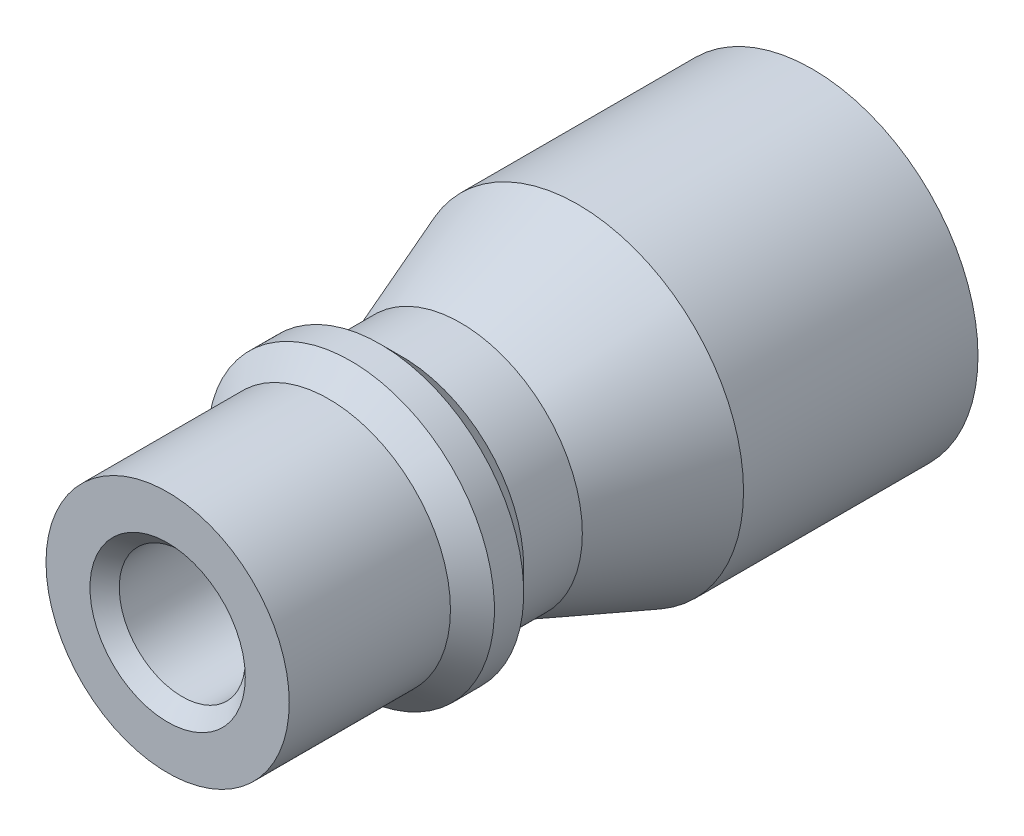
ISO-10303-21;
HEADER;
FILE_DESCRIPTION(('STEP AP214'),'2;1');
FILE_NAME('part.step','',(''),(''),'','','');
FILE_SCHEMA(('AUTOMOTIVE_DESIGN { 1 0 10303 214 1 1 1 1 }'));
ENDSEC;
DATA;
#1=APPLICATION_CONTEXT('core data for automotive mechanical design processes');
#2=APPLICATION_PROTOCOL_DEFINITION('international standard','automotive_design',2000,#1);
#3=PRODUCT_CONTEXT('',#1,'mechanical');
#4=PRODUCT('Part','Part','',(#3));
#5=PRODUCT_RELATED_PRODUCT_CATEGORY('part','',(#4));
#6=PRODUCT_DEFINITION_FORMATION('','',#4);
#7=PRODUCT_DEFINITION_CONTEXT('part definition',#1,'design');
#8=PRODUCT_DEFINITION('design','',#6,#7);
#9=PRODUCT_DEFINITION_SHAPE('','',#8);
#10=(LENGTH_UNIT() NAMED_UNIT(*) SI_UNIT(.MILLI.,.METRE.));
#11=(NAMED_UNIT(*) PLANE_ANGLE_UNIT() SI_UNIT($,.RADIAN.));
#12=(NAMED_UNIT(*) SI_UNIT($,.STERADIAN.) SOLID_ANGLE_UNIT());
#13=UNCERTAINTY_MEASURE_WITH_UNIT(LENGTH_MEASURE(1.E-05),#10,'distance_accuracy_value','');
#14=(GEOMETRIC_REPRESENTATION_CONTEXT(3) GLOBAL_UNCERTAINTY_ASSIGNED_CONTEXT((#13)) GLOBAL_UNIT_ASSIGNED_CONTEXT((#10,
#11,#12)) REPRESENTATION_CONTEXT('',''));
#15=CARTESIAN_POINT('',(0.,0.,0.));
#16=DIRECTION('',(0.,0.,1.));
#17=DIRECTION('',(1.,0.,0.));
#18=AXIS2_PLACEMENT_3D('',#15,#16,#17);
#19=CARTESIAN_POINT('',(0.,0.,22.));
#20=DIRECTION('',(0.,0.,-1.));
#21=DIRECTION('',(-1.,0.,0.));
#22=AXIS2_PLACEMENT_3D('',#19,#20,#21);
#23=CYLINDRICAL_SURFACE('',#22,4.15);
#24=CARTESIAN_POINT('',(0.,0.,14.));
#25=DIRECTION('',(0.,0.,-1.));
#26=DIRECTION('',(-1.,0.,0.));
#27=AXIS2_PLACEMENT_3D('',#24,#25,#26);
#28=CIRCLE('',#27,4.15);
#29=CARTESIAN_POINT('',(-4.15,0.,14.));
#30=VERTEX_POINT('',#29);
#31=EDGE_CURVE('E93',#30,#30,#28,.T.);
#32=ORIENTED_EDGE('',*,*,#31,.T.);
#33=EDGE_LOOP('',(#32));
#34=FACE_BOUND('',#33,.T.);
#35=CARTESIAN_POINT('',(0.,0.,12.));
#36=DIRECTION('',(0.,0.,1.));
#37=DIRECTION('',(1.,0.,0.));
#38=AXIS2_PLACEMENT_3D('',#35,#36,#37);
#39=CIRCLE('',#38,4.15);
#40=CARTESIAN_POINT('',(4.15,0.,12.));
#41=VERTEX_POINT('',#40);
#42=EDGE_CURVE('E55',#41,#41,#39,.T.);
#43=ORIENTED_EDGE('',*,*,#42,.T.);
#44=EDGE_LOOP('',(#43));
#45=FACE_BOUND('',#44,.T.);
#46=ADVANCED_FACE('F34',(#34,#45),#23,.T.);
#47=CARTESIAN_POINT('',(0.,0.,0.));
#48=DIRECTION('',(0.,0.,1.));
#49=DIRECTION('',(1.,0.,0.));
#50=AXIS2_PLACEMENT_3D('',#47,#48,#49);
#51=PLANE('',#50);
#52=CARTESIAN_POINT('',(0.,0.,0.));
#53=DIRECTION('',(0.,0.,1.));
#54=DIRECTION('',(1.,0.,0.));
#55=AXIS2_PLACEMENT_3D('',#52,#53,#54);
#56=CIRCLE('',#55,4.15);
#57=CARTESIAN_POINT('',(4.15,0.,0.));
#58=VERTEX_POINT('',#57);
#59=EDGE_CURVE('E49',#58,#58,#56,.T.);
#60=ORIENTED_EDGE('',*,*,#59,.T.);
#61=EDGE_LOOP('',(#60));
#62=FACE_BOUND('',#61,.T.);
#63=CARTESIAN_POINT('',(0.,0.,0.));
#64=DIRECTION('',(0.,0.,1.));
#65=DIRECTION('',(1.,0.,0.));
#66=AXIS2_PLACEMENT_3D('',#63,#64,#65);
#67=CIRCLE('',#66,5.65);
#68=CARTESIAN_POINT('',(5.65,0.,0.));
#69=VERTEX_POINT('',#68);
#70=EDGE_CURVE('E59',#69,#69,#67,.T.);
#71=ORIENTED_EDGE('',*,*,#70,.F.);
#72=EDGE_LOOP('',(#71));
#73=FACE_BOUND('',#72,.T.);
#74=ADVANCED_FACE('F125',(#62,#73),#51,.F.);
#75=CARTESIAN_POINT('',(0.,0.,8.));
#76=DIRECTION('',(0.,0.,-1.));
#77=DIRECTION('',(-1.,0.,0.));
#78=AXIS2_PLACEMENT_3D('',#75,#76,#77);
#79=CYLINDRICAL_SURFACE('',#78,5.65);
#80=CARTESIAN_POINT('',(0.,0.,8.));
#81=DIRECTION('',(0.,0.,-1.));
#82=DIRECTION('',(-1.,0.,0.));
#83=AXIS2_PLACEMENT_3D('',#80,#81,#82);
#84=CIRCLE('',#83,5.65);
#85=CARTESIAN_POINT('',(-5.65,0.,8.));
#86=VERTEX_POINT('',#85);
#87=EDGE_CURVE('E74',#86,#86,#84,.F.);
#88=ORIENTED_EDGE('',*,*,#87,.F.);
#89=EDGE_LOOP('',(#88));
#90=FACE_BOUND('',#89,.T.);
#91=ORIENTED_EDGE('',*,*,#70,.T.);
#92=EDGE_LOOP('',(#91));
#93=FACE_BOUND('',#92,.T.);
#94=ADVANCED_FACE('F130',(#90,#93),#79,.T.);
#95=CARTESIAN_POINT('',(0.,0.,8.));
#96=DIRECTION('',(0.,0.,-1.));
#97=DIRECTION('',(-1.,0.,0.));
#98=AXIS2_PLACEMENT_3D('',#95,#96,#97);
#99=CYLINDRICAL_SURFACE('',#98,3.65);
#100=CARTESIAN_POINT('',(0.,0.,0.5));
#101=DIRECTION('',(0.,0.,1.));
#102=DIRECTION('',(1.,0.,0.));
#103=AXIS2_PLACEMENT_3D('',#100,#101,#102);
#104=CIRCLE('',#103,3.65);
#105=CARTESIAN_POINT('',(3.65,0.,0.5));
#106=VERTEX_POINT('',#105);
#107=EDGE_CURVE('E45',#106,#106,#104,.F.);
#108=ORIENTED_EDGE('',*,*,#107,.T.);
#109=EDGE_LOOP('',(#108));
#110=FACE_BOUND('',#109,.T.);
#111=CARTESIAN_POINT('',(0.,0.,8.));
#112=DIRECTION('',(0.,0.,-1.));
#113=DIRECTION('',(-1.,0.,0.));
#114=AXIS2_PLACEMENT_3D('',#111,#112,#113);
#115=CIRCLE('',#114,3.65);
#116=CARTESIAN_POINT('',(-3.65,0.,8.));
#117=VERTEX_POINT('',#116);
#118=EDGE_CURVE('E87',#117,#117,#115,.T.);
#119=ORIENTED_EDGE('',*,*,#118,.F.);
#120=EDGE_LOOP('',(#119));
#121=FACE_BOUND('',#120,.T.);
#122=ADVANCED_FACE('F146',(#110,#121),#99,.F.);
#123=CARTESIAN_POINT('',(0.,0.,12.));
#124=DIRECTION('',(0.,0.,-1.));
#125=DIRECTION('',(-1.,0.,0.));
#126=AXIS2_PLACEMENT_3D('',#123,#124,#125);
#127=CONICAL_SURFACE('',#126,4.15,0.358770670270572);
#128=ORIENTED_EDGE('',*,*,#87,.T.);
#129=EDGE_LOOP('',(#128));
#130=FACE_BOUND('',#129,.T.);
#131=ORIENTED_EDGE('',*,*,#42,.F.);
#132=EDGE_LOOP('',(#131));
#133=FACE_BOUND('',#132,.T.);
#134=ADVANCED_FACE('F83',(#130,#133),#127,.T.);
#135=CARTESIAN_POINT('',(0.,0.,8.));
#136=DIRECTION('',(0.,0.,-1.));
#137=DIRECTION('',(-1.,0.,0.));
#138=AXIS2_PLACEMENT_3D('',#135,#136,#137);
#139=CONICAL_SURFACE('',#138,3.65,0.855211333477222);
#140=CARTESIAN_POINT('',(0.,0.,11.));
#141=DIRECTION('',(0.,0.,-1.));
#142=DIRECTION('',(-1.,0.,0.));
#143=AXIS2_PLACEMENT_3D('',#140,#141,#142);
#144=CIRCLE('',#143,0.198894778336966);
#145=CARTESIAN_POINT('',(-0.198894778336966,0.,11.));
#146=VERTEX_POINT('',#145);
#147=EDGE_CURVE('E60',#146,#146,#144,.T.);
#148=ORIENTED_EDGE('',*,*,#147,.F.);
#149=EDGE_LOOP('',(#148));
#150=FACE_BOUND('',#149,.T.);
#151=ORIENTED_EDGE('',*,*,#118,.T.);
#152=EDGE_LOOP('',(#151));
#153=FACE_BOUND('',#152,.T.);
#154=ADVANCED_FACE('F139',(#150,#153),#139,.F.);
#155=CARTESIAN_POINT('',(0.,0.,11.));
#156=DIRECTION('',(0.,0.,-1.));
#157=DIRECTION('',(-1.,0.,0.));
#158=AXIS2_PLACEMENT_3D('',#155,#156,#157);
#159=PLANE('',#158);
#160=ORIENTED_EDGE('',*,*,#147,.T.);
#161=EDGE_LOOP('',(#160));
#162=FACE_BOUND('',#161,.T.);
#163=ADVANCED_FACE('F135',(#162),#159,.T.);
#164=CARTESIAN_POINT('',(0.,0.,14.));
#165=DIRECTION('',(0.,0.,1.));
#166=DIRECTION('',(1.,0.,0.));
#167=AXIS2_PLACEMENT_3D('',#164,#165,#166);
#168=CONICAL_SURFACE('',#167,4.15,0.785398163397448);
#169=CARTESIAN_POINT('',(0.,0.,14.75));
#170=DIRECTION('',(0.,0.,-1.));
#171=DIRECTION('',(-1.,0.,0.));
#172=AXIS2_PLACEMENT_3D('',#169,#170,#171);
#173=CIRCLE('',#172,4.9);
#174=CARTESIAN_POINT('',(-4.9,0.,14.75));
#175=VERTEX_POINT('',#174);
#176=EDGE_CURVE('E96',#175,#175,#173,.T.);
#177=ORIENTED_EDGE('',*,*,#176,.T.);
#178=EDGE_LOOP('',(#177));
#179=FACE_BOUND('',#178,.T.);
#180=ORIENTED_EDGE('',*,*,#31,.F.);
#181=EDGE_LOOP('',(#180));
#182=FACE_BOUND('',#181,.T.);
#183=ADVANCED_FACE('F138',(#179,#182),#168,.T.);
#184=CARTESIAN_POINT('',(0.,0.,-80.9));
#185=DIRECTION('',(0.,0.,-1.));
#186=DIRECTION('',(-1.,0.,0.));
#187=AXIS2_PLACEMENT_3D('',#184,#185,#186);
#188=CYLINDRICAL_SURFACE('',#187,4.9);
#189=CARTESIAN_POINT('',(0.,0.,15.75));
#190=DIRECTION('',(0.,0.,-1.));
#191=DIRECTION('',(-1.,0.,0.));
#192=AXIS2_PLACEMENT_3D('',#189,#190,#191);
#193=CIRCLE('',#192,4.9);
#194=CARTESIAN_POINT('',(-4.9,0.,15.75));
#195=VERTEX_POINT('',#194);
#196=EDGE_CURVE('E99',#195,#195,#193,.T.);
#197=ORIENTED_EDGE('',*,*,#196,.T.);
#198=EDGE_LOOP('',(#197));
#199=FACE_BOUND('',#198,.T.);
#200=ORIENTED_EDGE('',*,*,#176,.F.);
#201=EDGE_LOOP('',(#200));
#202=FACE_BOUND('',#201,.T.);
#203=ADVANCED_FACE('F219',(#199,#202),#188,.T.);
#204=CARTESIAN_POINT('',(0.,0.,15.75));
#205=DIRECTION('',(0.,0.,-1.));
#206=DIRECTION('',(-1.,0.,0.));
#207=AXIS2_PLACEMENT_3D('',#204,#205,#206);
#208=CONICAL_SURFACE('',#207,4.9,0.785398163397448);
#209=CARTESIAN_POINT('',(0.,0.,16.5));
#210=DIRECTION('',(0.,0.,-1.));
#211=DIRECTION('',(-1.,0.,0.));
#212=AXIS2_PLACEMENT_3D('',#209,#210,#211);
#213=CIRCLE('',#212,4.15);
#214=CARTESIAN_POINT('',(-4.15,0.,16.5));
#215=VERTEX_POINT('',#214);
#216=EDGE_CURVE('E102',#215,#215,#213,.T.);
#217=ORIENTED_EDGE('',*,*,#216,.T.);
#218=EDGE_LOOP('',(#217));
#219=FACE_BOUND('',#218,.T.);
#220=ORIENTED_EDGE('',*,*,#196,.F.);
#221=EDGE_LOOP('',(#220));
#222=FACE_BOUND('',#221,.T.);
#223=ADVANCED_FACE('F106',(#219,#222),#208,.T.);
#224=CARTESIAN_POINT('',(0.,0.,12.));
#225=DIRECTION('',(0.,0.,1.));
#226=DIRECTION('',(1.,0.,0.));
#227=AXIS2_PLACEMENT_3D('',#224,#225,#226);
#228=PLANE('',#227);
#229=CARTESIAN_POINT('',(0.,0.,12.));
#230=DIRECTION('',(0.,0.,1.));
#231=DIRECTION('',(1.,0.,0.));
#232=AXIS2_PLACEMENT_3D('',#229,#230,#231);
#233=CIRCLE('',#232,2.15);
#234=CARTESIAN_POINT('',(2.15,0.,12.));
#235=VERTEX_POINT('',#234);
#236=EDGE_CURVE('E54',#235,#235,#233,.F.);
#237=ORIENTED_EDGE('',*,*,#236,.F.);
#238=EDGE_LOOP('',(#237));
#239=FACE_BOUND('',#238,.T.);
#240=ADVANCED_FACE('F122',(#239),#228,.T.);
#241=CARTESIAN_POINT('',(0.,0.,22.));
#242=DIRECTION('',(0.,0.,-1.));
#243=DIRECTION('',(-1.,0.,0.));
#244=AXIS2_PLACEMENT_3D('',#241,#242,#243);
#245=CYLINDRICAL_SURFACE('',#244,2.15);
#246=CARTESIAN_POINT('',(0.,0.,21.5));
#247=DIRECTION('',(0.,0.,1.));
#248=DIRECTION('',(1.,0.,0.));
#249=AXIS2_PLACEMENT_3D('',#246,#247,#248);
#250=CIRCLE('',#249,2.15);
#251=CARTESIAN_POINT('',(2.15,0.,21.5));
#252=VERTEX_POINT('',#251);
#253=EDGE_CURVE('E41',#252,#252,#250,.T.);
#254=ORIENTED_EDGE('',*,*,#253,.T.);
#255=EDGE_LOOP('',(#254));
#256=FACE_BOUND('',#255,.T.);
#257=ORIENTED_EDGE('',*,*,#236,.T.);
#258=EDGE_LOOP('',(#257));
#259=FACE_BOUND('',#258,.T.);
#260=ADVANCED_FACE('F117',(#256,#259),#245,.F.);
#261=CARTESIAN_POINT('',(0.,0.,22.));
#262=DIRECTION('',(0.,0.,1.));
#263=DIRECTION('',(1.,0.,0.));
#264=AXIS2_PLACEMENT_3D('',#261,#262,#263);
#265=PLANE('',#264);
#266=CARTESIAN_POINT('',(0.,0.,22.));
#267=DIRECTION('',(0.,0.,1.));
#268=DIRECTION('',(1.,0.,0.));
#269=AXIS2_PLACEMENT_3D('',#266,#267,#268);
#270=CIRCLE('',#269,2.65);
#271=CARTESIAN_POINT('',(2.65,0.,22.));
#272=VERTEX_POINT('',#271);
#273=EDGE_CURVE('E11',#272,#272,#270,.F.);
#274=ORIENTED_EDGE('',*,*,#273,.T.);
#275=EDGE_LOOP('',(#274));
#276=FACE_BOUND('',#275,.T.);
#277=CARTESIAN_POINT('',(0.,0.,22.));
#278=DIRECTION('',(0.,0.,1.));
#279=DIRECTION('',(1.,0.,0.));
#280=AXIS2_PLACEMENT_3D('',#277,#278,#279);
#281=CIRCLE('',#280,4.15);
#282=CARTESIAN_POINT('',(4.15,0.,22.));
#283=VERTEX_POINT('',#282);
#284=EDGE_CURVE('E90',#283,#283,#281,.T.);
#285=ORIENTED_EDGE('',*,*,#284,.T.);
#286=EDGE_LOOP('',(#285));
#287=FACE_BOUND('',#286,.T.);
#288=ADVANCED_FACE('F113',(#276,#287),#265,.T.);
#289=ORIENTED_EDGE('',*,*,#216,.F.);
#290=EDGE_LOOP('',(#289));
#291=FACE_BOUND('',#290,.T.);
#292=ORIENTED_EDGE('',*,*,#284,.F.);
#293=EDGE_LOOP('',(#292));
#294=FACE_BOUND('',#293,.T.);
#295=ADVANCED_FACE('F109',(#291,#294),#23,.T.);
#296=CARTESIAN_POINT('',(0.,0.,0.));
#297=DIRECTION('',(0.,0.,-1.));
#298=DIRECTION('',(-1.,0.,0.));
#299=AXIS2_PLACEMENT_3D('',#296,#297,#298);
#300=CONICAL_SURFACE('',#299,4.15,0.785398163397447);
#301=ORIENTED_EDGE('',*,*,#107,.F.);
#302=EDGE_LOOP('',(#301));
#303=FACE_BOUND('',#302,.T.);
#304=ORIENTED_EDGE('',*,*,#59,.F.);
#305=EDGE_LOOP('',(#304));
#306=FACE_BOUND('',#305,.T.);
#307=ADVANCED_FACE('F112',(#303,#306),#300,.F.);
#308=CARTESIAN_POINT('',(0.,0.,21.5));
#309=DIRECTION('',(0.,0.,1.));
#310=DIRECTION('',(1.,0.,0.));
#311=AXIS2_PLACEMENT_3D('',#308,#309,#310);
#312=CONICAL_SURFACE('',#311,2.15,0.785398163397454);
#313=ORIENTED_EDGE('',*,*,#273,.F.);
#314=EDGE_LOOP('',(#313));
#315=FACE_BOUND('',#314,.T.);
#316=ORIENTED_EDGE('',*,*,#253,.F.);
#317=EDGE_LOOP('',(#316));
#318=FACE_BOUND('',#317,.T.);
#319=ADVANCED_FACE('F36',(#315,#318),#312,.F.);
#320=CLOSED_SHELL('',(#46,#74,#94,#122,#134,#154,#163,#183,#203,#223,#240,#260,#288,#295,#307,#319));
#321=MANIFOLD_SOLID_BREP('B2',#320);
#322=ADVANCED_BREP_SHAPE_REPRESENTATION('',(#18,#321),#14);
#323=SHAPE_DEFINITION_REPRESENTATION(#9,#322);
ENDSEC;
END-ISO-10303-21;
